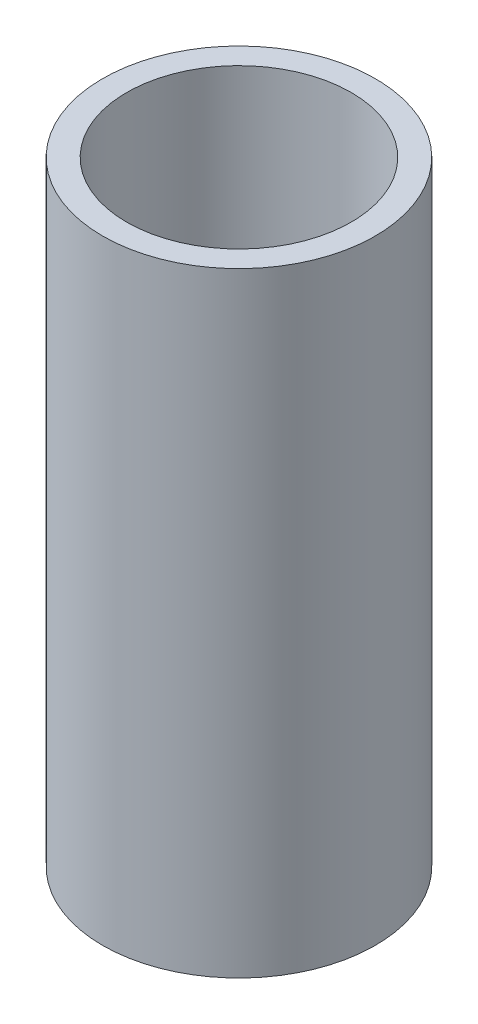
ISO-10303-21;
HEADER;
FILE_DESCRIPTION(('STEP AP214'),'2;1');
FILE_NAME('part.step','',(''),(''),'','','');
FILE_SCHEMA(('AUTOMOTIVE_DESIGN { 1 0 10303 214 1 1 1 1 }'));
ENDSEC;
DATA;
#1=APPLICATION_CONTEXT('core data for automotive mechanical design processes');
#2=APPLICATION_PROTOCOL_DEFINITION('international standard','automotive_design',2000,#1);
#3=PRODUCT_CONTEXT('',#1,'mechanical');
#4=PRODUCT('Part','Part','',(#3));
#5=PRODUCT_RELATED_PRODUCT_CATEGORY('part','',(#4));
#6=PRODUCT_DEFINITION_FORMATION('','',#4);
#7=PRODUCT_DEFINITION_CONTEXT('part definition',#1,'design');
#8=PRODUCT_DEFINITION('design','',#6,#7);
#9=PRODUCT_DEFINITION_SHAPE('','',#8);
#10=(LENGTH_UNIT() NAMED_UNIT(*) SI_UNIT(.MILLI.,.METRE.));
#11=(NAMED_UNIT(*) PLANE_ANGLE_UNIT() SI_UNIT($,.RADIAN.));
#12=(NAMED_UNIT(*) SI_UNIT($,.STERADIAN.) SOLID_ANGLE_UNIT());
#13=UNCERTAINTY_MEASURE_WITH_UNIT(LENGTH_MEASURE(1.E-05),#10,'distance_accuracy_value','');
#14=(GEOMETRIC_REPRESENTATION_CONTEXT(3) GLOBAL_UNCERTAINTY_ASSIGNED_CONTEXT((#13)) GLOBAL_UNIT_ASSIGNED_CONTEXT((#10,
#11,#12)) REPRESENTATION_CONTEXT('',''));
#15=CARTESIAN_POINT('',(0.,0.,0.));
#16=DIRECTION('',(0.,0.,1.));
#17=DIRECTION('',(1.,0.,0.));
#18=AXIS2_PLACEMENT_3D('',#15,#16,#17);
#19=CARTESIAN_POINT('',(0.,168.980564982148,0.));
#20=DIRECTION('',(0.,-1.,0.));
#21=DIRECTION('',(0.,0.,-1.));
#22=AXIS2_PLACEMENT_3D('',#19,#20,#21);
#23=CYLINDRICAL_SURFACE('',#22,37.5);
#24=CARTESIAN_POINT('',(0.,168.980564982148,0.));
#25=DIRECTION('',(0.,1.,0.));
#26=DIRECTION('',(0.,0.,1.));
#27=AXIS2_PLACEMENT_3D('',#24,#25,#26);
#28=CIRCLE('',#27,37.5);
#29=CARTESIAN_POINT('',(0.,168.980564982148,37.5));
#30=VERTEX_POINT('',#29);
#31=EDGE_CURVE('E10',#30,#30,#28,.T.);
#32=ORIENTED_EDGE('',*,*,#31,.F.);
#33=EDGE_LOOP('',(#32));
#34=FACE_BOUND('',#33,.T.);
#35=CARTESIAN_POINT('',(0.,0.,0.));
#36=DIRECTION('',(0.,1.,0.));
#37=DIRECTION('',(0.,0.,1.));
#38=AXIS2_PLACEMENT_3D('',#35,#36,#37);
#39=CIRCLE('',#38,37.5);
#40=CARTESIAN_POINT('',(0.,0.,37.5));
#41=VERTEX_POINT('',#40);
#42=EDGE_CURVE('E37',#41,#41,#39,.T.);
#43=ORIENTED_EDGE('',*,*,#42,.T.);
#44=EDGE_LOOP('',(#43));
#45=FACE_BOUND('',#44,.T.);
#46=ADVANCED_FACE('F40',(#34,#45),#23,.T.);
#47=CARTESIAN_POINT('',(0.,168.980564982148,0.));
#48=DIRECTION('',(0.,1.,0.));
#49=DIRECTION('',(0.,0.,1.));
#50=AXIS2_PLACEMENT_3D('',#47,#48,#49);
#51=PLANE('',#50);
#52=CARTESIAN_POINT('',(0.,168.980564982148,0.));
#53=DIRECTION('',(0.,1.,0.));
#54=DIRECTION('',(0.,0.,1.));
#55=AXIS2_PLACEMENT_3D('',#52,#53,#54);
#56=CIRCLE('',#55,30.8902341986346);
#57=CARTESIAN_POINT('',(0.,168.980564982148,30.8902341986346));
#58=VERTEX_POINT('',#57);
#59=EDGE_CURVE('E50',#58,#58,#56,.T.);
#60=ORIENTED_EDGE('',*,*,#59,.F.);
#61=EDGE_LOOP('',(#60));
#62=FACE_BOUND('',#61,.T.);
#63=ORIENTED_EDGE('',*,*,#31,.T.);
#64=EDGE_LOOP('',(#63));
#65=FACE_BOUND('',#64,.T.);
#66=ADVANCED_FACE('F59',(#62,#65),#51,.T.);
#67=CARTESIAN_POINT('',(0.,0.,0.));
#68=DIRECTION('',(0.,1.,0.));
#69=DIRECTION('',(0.,0.,1.));
#70=AXIS2_PLACEMENT_3D('',#67,#68,#69);
#71=PLANE('',#70);
#72=CARTESIAN_POINT('',(0.,0.,0.));
#73=DIRECTION('',(0.,1.,0.));
#74=DIRECTION('',(0.,0.,1.));
#75=AXIS2_PLACEMENT_3D('',#72,#73,#74);
#76=CIRCLE('',#75,30.8902341986346);
#77=CARTESIAN_POINT('',(0.,0.,30.8902341986346));
#78=VERTEX_POINT('',#77);
#79=EDGE_CURVE('E47',#78,#78,#76,.T.);
#80=ORIENTED_EDGE('',*,*,#79,.T.);
#81=EDGE_LOOP('',(#80));
#82=FACE_BOUND('',#81,.T.);
#83=ORIENTED_EDGE('',*,*,#42,.F.);
#84=EDGE_LOOP('',(#83));
#85=FACE_BOUND('',#84,.T.);
#86=ADVANCED_FACE('F58',(#82,#85),#71,.F.);
#87=CARTESIAN_POINT('',(0.,168.980564982148,0.));
#88=DIRECTION('',(0.,-1.,0.));
#89=DIRECTION('',(0.,0.,-1.));
#90=AXIS2_PLACEMENT_3D('',#87,#88,#89);
#91=CYLINDRICAL_SURFACE('',#90,30.8902341986346);
#92=ORIENTED_EDGE('',*,*,#59,.T.);
#93=EDGE_LOOP('',(#92));
#94=FACE_BOUND('',#93,.T.);
#95=ORIENTED_EDGE('',*,*,#79,.F.);
#96=EDGE_LOOP('',(#95));
#97=FACE_BOUND('',#96,.T.);
#98=ADVANCED_FACE('F54',(#94,#97),#91,.F.);
#99=CLOSED_SHELL('',(#46,#66,#86,#98));
#100=MANIFOLD_SOLID_BREP('B2',#99);
#101=ADVANCED_BREP_SHAPE_REPRESENTATION('',(#18,#100),#14);
#102=SHAPE_DEFINITION_REPRESENTATION(#9,#101);
ENDSEC;
END-ISO-10303-21;
